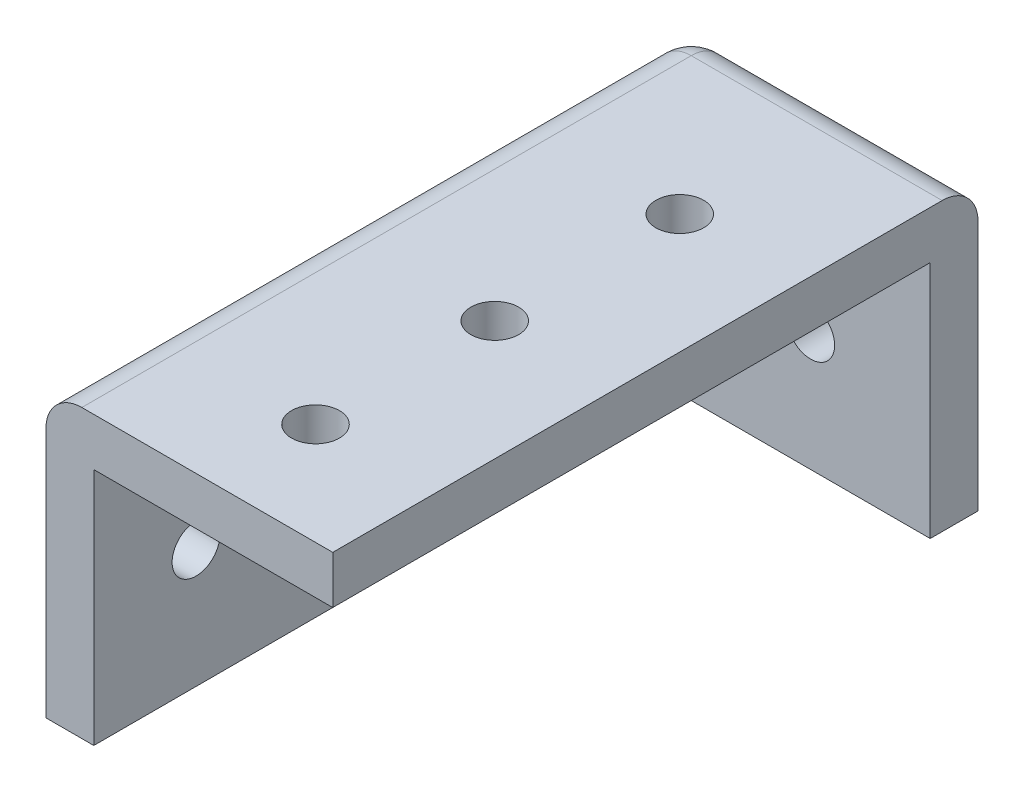
ISO-10303-21;
HEADER;
FILE_DESCRIPTION(('STEP AP214'),'2;1');
FILE_NAME('part.step','',(''),(''),'','','');
FILE_SCHEMA(('AUTOMOTIVE_DESIGN { 1 0 10303 214 1 1 1 1 }'));
ENDSEC;
DATA;
#1=APPLICATION_CONTEXT('core data for automotive mechanical design processes');
#2=APPLICATION_PROTOCOL_DEFINITION('international standard','automotive_design',2000,#1);
#3=PRODUCT_CONTEXT('',#1,'mechanical');
#4=PRODUCT('Part','Part','',(#3));
#5=PRODUCT_RELATED_PRODUCT_CATEGORY('part','',(#4));
#6=PRODUCT_DEFINITION_FORMATION('','',#4);
#7=PRODUCT_DEFINITION_CONTEXT('part definition',#1,'design');
#8=PRODUCT_DEFINITION('design','',#6,#7);
#9=PRODUCT_DEFINITION_SHAPE('','',#8);
#10=(LENGTH_UNIT() NAMED_UNIT(*) SI_UNIT(.MILLI.,.METRE.));
#11=(NAMED_UNIT(*) PLANE_ANGLE_UNIT() SI_UNIT($,.RADIAN.));
#12=(NAMED_UNIT(*) SI_UNIT($,.STERADIAN.) SOLID_ANGLE_UNIT());
#13=UNCERTAINTY_MEASURE_WITH_UNIT(LENGTH_MEASURE(1.E-05),#10,'distance_accuracy_value','');
#14=(GEOMETRIC_REPRESENTATION_CONTEXT(3) GLOBAL_UNCERTAINTY_ASSIGNED_CONTEXT((#13)) GLOBAL_UNIT_ASSIGNED_CONTEXT((#10,
#11,#12)) REPRESENTATION_CONTEXT('',''));
#15=CARTESIAN_POINT('',(0.,0.,0.));
#16=DIRECTION('',(0.,0.,1.));
#17=DIRECTION('',(1.,0.,0.));
#18=AXIS2_PLACEMENT_3D('',#15,#16,#17);
#19=CARTESIAN_POINT('',(4.,0.,50.));
#20=DIRECTION('',(0.,1.,0.));
#21=DIRECTION('',(0.,0.,1.));
#22=AXIS2_PLACEMENT_3D('',#19,#20,#21);
#23=PLANE('',#22);
#24=DIRECTION('',(0.,0.,-1.));
#25=VECTOR('',#24,1.);
#26=CARTESIAN_POINT('',(0.,0.,50.));
#27=LINE('',#26,#25);
#28=CARTESIAN_POINT('',(0.,0.,50.));
#29=VERTEX_POINT('',#28);
#30=CARTESIAN_POINT('',(0.,0.,-1.));
#31=VERTEX_POINT('',#30);
#32=EDGE_CURVE('E157',#29,#31,#27,.T.);
#33=ORIENTED_EDGE('',*,*,#32,.T.);
#34=CARTESIAN_POINT('',(3.,0.,-1.));
#35=DIRECTION('',(0.,1.,0.));
#36=DIRECTION('',(0.,0.,1.));
#37=AXIS2_PLACEMENT_3D('',#34,#35,#36);
#38=CIRCLE('',#37,3.);
#39=CARTESIAN_POINT('',(3.,0.,-4.));
#40=VERTEX_POINT('',#39);
#41=EDGE_CURVE('E119',#31,#40,#38,.F.);
#42=ORIENTED_EDGE('',*,*,#41,.T.);
#43=DIRECTION('',(1.,0.,0.));
#44=VECTOR('',#43,1.);
#45=CARTESIAN_POINT('',(0.,0.,-4.));
#46=LINE('',#45,#44);
#47=CARTESIAN_POINT('',(24.,0.,-4.));
#48=VERTEX_POINT('',#47);
#49=EDGE_CURVE('E113',#40,#48,#46,.T.);
#50=ORIENTED_EDGE('',*,*,#49,.T.);
#51=DIRECTION('',(0.,0.,1.));
#52=VECTOR('',#51,1.);
#53=CARTESIAN_POINT('',(24.,0.,-4.));
#54=LINE('',#53,#52);
#55=CARTESIAN_POINT('',(24.,0.,0.));
#56=VERTEX_POINT('',#55);
#57=EDGE_CURVE('E117',#48,#56,#54,.T.);
#58=ORIENTED_EDGE('',*,*,#57,.T.);
#59=DIRECTION('',(1.,0.,0.));
#60=VECTOR('',#59,1.);
#61=CARTESIAN_POINT('',(0.,0.,0.));
#62=LINE('',#61,#60);
#63=CARTESIAN_POINT('',(4.,0.,0.));
#64=VERTEX_POINT('',#63);
#65=EDGE_CURVE('E139',#64,#56,#62,.T.);
#66=ORIENTED_EDGE('',*,*,#65,.F.);
#67=DIRECTION('',(0.,0.,-1.));
#68=VECTOR('',#67,1.);
#69=CARTESIAN_POINT('',(4.,0.,50.));
#70=LINE('',#69,#68);
#71=CARTESIAN_POINT('',(4.,0.,50.));
#72=VERTEX_POINT('',#71);
#73=EDGE_CURVE('E170',#72,#64,#70,.T.);
#74=ORIENTED_EDGE('',*,*,#73,.F.);
#75=DIRECTION('',(1.,0.,0.));
#76=VECTOR('',#75,1.);
#77=CARTESIAN_POINT('',(4.,0.,50.));
#78=LINE('',#77,#76);
#79=EDGE_CURVE('E143',#29,#72,#78,.T.);
#80=ORIENTED_EDGE('',*,*,#79,.F.);
#81=EDGE_LOOP('',(#33,#42,#50,#58,#66,#74,#80));
#82=FACE_BOUND('',#81,.T.);
#83=ADVANCED_FACE('F38',(#82),#23,.F.);
#84=CARTESIAN_POINT('',(4.,20.,50.));
#85=DIRECTION('',(-1.,0.,0.));
#86=DIRECTION('',(0.,0.,1.));
#87=AXIS2_PLACEMENT_3D('',#84,#85,#86);
#88=PLANE('',#87);
#89=CARTESIAN_POINT('',(3.99999999999999,9.99999999999998,41.4458710177428));
#90=DIRECTION('',(1.,0.,0.));
#91=DIRECTION('',(0.,0.,1.));
#92=AXIS2_PLACEMENT_3D('',#89,#90,#91);
#93=CIRCLE('',#92,2.);
#94=CARTESIAN_POINT('',(3.99999999999999,9.99999999999998,43.4458710177428));
#95=VERTEX_POINT('',#94);
#96=EDGE_CURVE('E196',#95,#95,#93,.T.);
#97=ORIENTED_EDGE('',*,*,#96,.F.);
#98=EDGE_LOOP('',(#97));
#99=FACE_BOUND('',#98,.T.);
#100=CARTESIAN_POINT('',(3.99999999999999,9.99999999999998,10.9600417917341));
#101=DIRECTION('',(1.,0.,0.));
#102=DIRECTION('',(0.,0.,1.));
#103=AXIS2_PLACEMENT_3D('',#100,#101,#102);
#104=CIRCLE('',#103,2.);
#105=CARTESIAN_POINT('',(3.99999999999999,9.99999999999998,12.9600417917341));
#106=VERTEX_POINT('',#105);
#107=EDGE_CURVE('E212',#106,#106,#104,.T.);
#108=ORIENTED_EDGE('',*,*,#107,.F.);
#109=EDGE_LOOP('',(#108));
#110=FACE_BOUND('',#109,.T.);
#111=CARTESIAN_POINT('',(3.99999999999999,9.99999999999998,26.4458710177428));
#112=DIRECTION('',(1.,0.,0.));
#113=DIRECTION('',(0.,0.,1.));
#114=AXIS2_PLACEMENT_3D('',#111,#112,#113);
#115=CIRCLE('',#114,2.);
#116=CARTESIAN_POINT('',(3.99999999999999,9.99999999999998,28.4458710177428));
#117=VERTEX_POINT('',#116);
#118=EDGE_CURVE('E205',#117,#117,#115,.T.);
#119=ORIENTED_EDGE('',*,*,#118,.F.);
#120=EDGE_LOOP('',(#119));
#121=FACE_BOUND('',#120,.T.);
#122=DIRECTION('',(0.,1.,0.));
#123=VECTOR('',#122,1.);
#124=CARTESIAN_POINT('',(4.,20.,0.));
#125=LINE('',#124,#123);
#126=CARTESIAN_POINT('',(4.,20.,0.));
#127=VERTEX_POINT('',#126);
#128=EDGE_CURVE('E131',#64,#127,#125,.T.);
#129=ORIENTED_EDGE('',*,*,#128,.T.);
#130=DIRECTION('',(0.,0.,-1.));
#131=VECTOR('',#130,1.);
#132=CARTESIAN_POINT('',(4.,20.,50.));
#133=LINE('',#132,#131);
#134=CARTESIAN_POINT('',(4.,20.,50.));
#135=VERTEX_POINT('',#134);
#136=EDGE_CURVE('E167',#135,#127,#133,.T.);
#137=ORIENTED_EDGE('',*,*,#136,.F.);
#138=DIRECTION('',(0.,1.,0.));
#139=VECTOR('',#138,1.);
#140=CARTESIAN_POINT('',(4.,20.,50.));
#141=LINE('',#140,#139);
#142=EDGE_CURVE('E146',#72,#135,#141,.T.);
#143=ORIENTED_EDGE('',*,*,#142,.F.);
#144=ORIENTED_EDGE('',*,*,#73,.T.);
#145=EDGE_LOOP('',(#129,#137,#143,#144));
#146=FACE_BOUND('',#145,.T.);
#147=ADVANCED_FACE('F251',(#99,#110,#121,#146),#88,.F.);
#148=CARTESIAN_POINT('',(24.,20.,50.));
#149=DIRECTION('',(0.,1.,0.));
#150=DIRECTION('',(-1.,0.,0.));
#151=AXIS2_PLACEMENT_3D('',#148,#149,#150);
#152=PLANE('',#151);
#153=CARTESIAN_POINT('',(14.,20.,41.4458710177428));
#154=DIRECTION('',(0.,1.,0.));
#155=DIRECTION('',(0.,0.,1.));
#156=AXIS2_PLACEMENT_3D('',#153,#154,#155);
#157=CIRCLE('',#156,2.);
#158=CARTESIAN_POINT('',(14.,20.,43.4458710177428));
#159=VERTEX_POINT('',#158);
#160=EDGE_CURVE('E208',#159,#159,#157,.T.);
#161=ORIENTED_EDGE('',*,*,#160,.T.);
#162=EDGE_LOOP('',(#161));
#163=FACE_BOUND('',#162,.T.);
#164=CARTESIAN_POINT('',(14.,20.,10.9600417917341));
#165=DIRECTION('',(0.,1.,0.));
#166=DIRECTION('',(0.,0.,1.));
#167=AXIS2_PLACEMENT_3D('',#164,#165,#166);
#168=CIRCLE('',#167,2.);
#169=CARTESIAN_POINT('',(14.,20.,12.9600417917341));
#170=VERTEX_POINT('',#169);
#171=EDGE_CURVE('E217',#170,#170,#168,.T.);
#172=ORIENTED_EDGE('',*,*,#171,.T.);
#173=EDGE_LOOP('',(#172));
#174=FACE_BOUND('',#173,.T.);
#175=CARTESIAN_POINT('',(14.,20.,26.4458710177428));
#176=DIRECTION('',(0.,1.,0.));
#177=DIRECTION('',(0.,0.,1.));
#178=AXIS2_PLACEMENT_3D('',#175,#176,#177);
#179=CIRCLE('',#178,2.);
#180=CARTESIAN_POINT('',(14.,20.,28.4458710177428));
#181=VERTEX_POINT('',#180);
#182=EDGE_CURVE('E225',#181,#181,#179,.T.);
#183=ORIENTED_EDGE('',*,*,#182,.T.);
#184=EDGE_LOOP('',(#183));
#185=FACE_BOUND('',#184,.T.);
#186=DIRECTION('',(1.,0.,0.));
#187=VECTOR('',#186,1.);
#188=CARTESIAN_POINT('',(24.,20.,0.));
#189=LINE('',#188,#187);
#190=CARTESIAN_POINT('',(24.,20.,0.));
#191=VERTEX_POINT('',#190);
#192=EDGE_CURVE('E147',#127,#191,#189,.T.);
#193=ORIENTED_EDGE('',*,*,#192,.T.);
#194=DIRECTION('',(0.,0.,-1.));
#195=VECTOR('',#194,1.);
#196=CARTESIAN_POINT('',(24.,20.,50.));
#197=LINE('',#196,#195);
#198=CARTESIAN_POINT('',(24.,20.,50.));
#199=VERTEX_POINT('',#198);
#200=EDGE_CURVE('E165',#199,#191,#197,.T.);
#201=ORIENTED_EDGE('',*,*,#200,.F.);
#202=DIRECTION('',(1.,0.,0.));
#203=VECTOR('',#202,1.);
#204=CARTESIAN_POINT('',(24.,20.,50.));
#205=LINE('',#204,#203);
#206=EDGE_CURVE('E149',#135,#199,#205,.T.);
#207=ORIENTED_EDGE('',*,*,#206,.F.);
#208=ORIENTED_EDGE('',*,*,#136,.T.);
#209=EDGE_LOOP('',(#193,#201,#207,#208));
#210=FACE_BOUND('',#209,.T.);
#211=ADVANCED_FACE('F256',(#163,#174,#185,#210),#152,.F.);
#212=CARTESIAN_POINT('',(24.,24.,50.));
#213=DIRECTION('',(-1.,0.,0.));
#214=DIRECTION('',(0.,0.,1.));
#215=AXIS2_PLACEMENT_3D('',#212,#213,#214);
#216=PLANE('',#215);
#217=DIRECTION('',(0.,1.,0.));
#218=VECTOR('',#217,1.);
#219=CARTESIAN_POINT('',(24.,0.,-4.));
#220=LINE('',#219,#218);
#221=CARTESIAN_POINT('',(24.,21.,-4.));
#222=VERTEX_POINT('',#221);
#223=EDGE_CURVE('E123',#48,#222,#220,.T.);
#224=ORIENTED_EDGE('',*,*,#223,.T.);
#225=CARTESIAN_POINT('',(24.,21.,-1.));
#226=DIRECTION('',(-1.,0.,0.));
#227=DIRECTION('',(0.,0.,1.));
#228=AXIS2_PLACEMENT_3D('',#225,#226,#227);
#229=CIRCLE('',#228,3.);
#230=CARTESIAN_POINT('',(24.,24.,-1.));
#231=VERTEX_POINT('',#230);
#232=EDGE_CURVE('E47',#222,#231,#229,.F.);
#233=ORIENTED_EDGE('',*,*,#232,.T.);
#234=DIRECTION('',(0.,0.,-1.));
#235=VECTOR('',#234,1.);
#236=CARTESIAN_POINT('',(24.,24.,50.));
#237=LINE('',#236,#235);
#238=CARTESIAN_POINT('',(24.,24.,50.));
#239=VERTEX_POINT('',#238);
#240=EDGE_CURVE('E163',#239,#231,#237,.T.);
#241=ORIENTED_EDGE('',*,*,#240,.F.);
#242=DIRECTION('',(0.,1.,0.));
#243=VECTOR('',#242,1.);
#244=CARTESIAN_POINT('',(24.,24.,50.));
#245=LINE('',#244,#243);
#246=EDGE_CURVE('E151',#199,#239,#245,.T.);
#247=ORIENTED_EDGE('',*,*,#246,.F.);
#248=ORIENTED_EDGE('',*,*,#200,.T.);
#249=DIRECTION('',(0.,1.,0.));
#250=VECTOR('',#249,1.);
#251=CARTESIAN_POINT('',(24.,0.,0.));
#252=LINE('',#251,#250);
#253=EDGE_CURVE('E124',#56,#191,#252,.T.);
#254=ORIENTED_EDGE('',*,*,#253,.F.);
#255=ORIENTED_EDGE('',*,*,#57,.F.);
#256=EDGE_LOOP('',(#224,#233,#241,#247,#248,#254,#255));
#257=FACE_BOUND('',#256,.T.);
#258=ADVANCED_FACE('F128',(#257),#216,.F.);
#259=CARTESIAN_POINT('',(0.,24.,50.));
#260=DIRECTION('',(0.,-1.,0.));
#261=DIRECTION('',(0.,0.,-1.));
#262=AXIS2_PLACEMENT_3D('',#259,#260,#261);
#263=PLANE('',#262);
#264=CARTESIAN_POINT('',(14.,24.,41.4458710177428));
#265=DIRECTION('',(0.,1.,0.));
#266=DIRECTION('',(0.,0.,1.));
#267=AXIS2_PLACEMENT_3D('',#264,#265,#266);
#268=CIRCLE('',#267,2.);
#269=CARTESIAN_POINT('',(14.,24.,43.4458710177428));
#270=VERTEX_POINT('',#269);
#271=EDGE_CURVE('E220',#270,#270,#268,.T.);
#272=ORIENTED_EDGE('',*,*,#271,.F.);
#273=EDGE_LOOP('',(#272));
#274=FACE_BOUND('',#273,.T.);
#275=CARTESIAN_POINT('',(14.,24.,10.9600417917341));
#276=DIRECTION('',(0.,1.,0.));
#277=DIRECTION('',(0.,0.,1.));
#278=AXIS2_PLACEMENT_3D('',#275,#276,#277);
#279=CIRCLE('',#278,2.);
#280=CARTESIAN_POINT('',(14.,24.,12.9600417917341));
#281=VERTEX_POINT('',#280);
#282=EDGE_CURVE('E213',#281,#281,#279,.T.);
#283=ORIENTED_EDGE('',*,*,#282,.F.);
#284=EDGE_LOOP('',(#283));
#285=FACE_BOUND('',#284,.T.);
#286=CARTESIAN_POINT('',(14.,24.,26.4458710177428));
#287=DIRECTION('',(0.,1.,0.));
#288=DIRECTION('',(0.,0.,1.));
#289=AXIS2_PLACEMENT_3D('',#286,#287,#288);
#290=CIRCLE('',#289,2.);
#291=CARTESIAN_POINT('',(14.,24.,28.4458710177428));
#292=VERTEX_POINT('',#291);
#293=EDGE_CURVE('E216',#292,#292,#290,.T.);
#294=ORIENTED_EDGE('',*,*,#293,.F.);
#295=EDGE_LOOP('',(#294));
#296=FACE_BOUND('',#295,.T.);
#297=ORIENTED_EDGE('',*,*,#240,.T.);
#298=DIRECTION('',(-1.,0.,0.));
#299=VECTOR('',#298,1.);
#300=CARTESIAN_POINT('',(0.,24.,-1.));
#301=LINE('',#300,#299);
#302=CARTESIAN_POINT('',(3.,24.,-1.));
#303=VERTEX_POINT('',#302);
#304=EDGE_CURVE('E55',#231,#303,#301,.T.);
#305=ORIENTED_EDGE('',*,*,#304,.T.);
#306=DIRECTION('',(0.,0.,-1.));
#307=VECTOR('',#306,1.);
#308=CARTESIAN_POINT('',(3.,24.,50.));
#309=LINE('',#308,#307);
#310=CARTESIAN_POINT('',(3.,24.,50.));
#311=VERTEX_POINT('',#310);
#312=EDGE_CURVE('E59',#303,#311,#309,.F.);
#313=ORIENTED_EDGE('',*,*,#312,.T.);
#314=DIRECTION('',(-1.,0.,0.));
#315=VECTOR('',#314,1.);
#316=CARTESIAN_POINT('',(0.,24.,50.));
#317=LINE('',#316,#315);
#318=EDGE_CURVE('E153',#239,#311,#317,.T.);
#319=ORIENTED_EDGE('',*,*,#318,.F.);
#320=EDGE_LOOP('',(#297,#305,#313,#319));
#321=FACE_BOUND('',#320,.T.);
#322=ADVANCED_FACE('F292',(#274,#285,#296,#321),#263,.F.);
#323=CARTESIAN_POINT('',(0.,0.,50.));
#324=DIRECTION('',(1.,0.,0.));
#325=DIRECTION('',(0.,0.,-1.));
#326=AXIS2_PLACEMENT_3D('',#323,#324,#325);
#327=PLANE('',#326);
#328=CARTESIAN_POINT('',(0.,9.99999999999998,41.4458710177428));
#329=DIRECTION('',(1.,0.,0.));
#330=DIRECTION('',(0.,0.,1.));
#331=AXIS2_PLACEMENT_3D('',#328,#329,#330);
#332=CIRCLE('',#331,2.);
#333=CARTESIAN_POINT('',(0.,9.99999999999998,43.4458710177428));
#334=VERTEX_POINT('',#333);
#335=EDGE_CURVE('E193',#334,#334,#332,.T.);
#336=ORIENTED_EDGE('',*,*,#335,.T.);
#337=EDGE_LOOP('',(#336));
#338=FACE_BOUND('',#337,.T.);
#339=CARTESIAN_POINT('',(0.,9.99999999999998,10.9600417917341));
#340=DIRECTION('',(1.,0.,0.));
#341=DIRECTION('',(0.,0.,1.));
#342=AXIS2_PLACEMENT_3D('',#339,#340,#341);
#343=CIRCLE('',#342,2.);
#344=CARTESIAN_POINT('',(0.,9.99999999999998,12.9600417917341));
#345=VERTEX_POINT('',#344);
#346=EDGE_CURVE('E201',#345,#345,#343,.T.);
#347=ORIENTED_EDGE('',*,*,#346,.T.);
#348=EDGE_LOOP('',(#347));
#349=FACE_BOUND('',#348,.T.);
#350=CARTESIAN_POINT('',(0.,9.99999999999998,26.4458710177428));
#351=DIRECTION('',(1.,0.,0.));
#352=DIRECTION('',(0.,0.,1.));
#353=AXIS2_PLACEMENT_3D('',#350,#351,#352);
#354=CIRCLE('',#353,2.);
#355=CARTESIAN_POINT('',(0.,9.99999999999998,28.4458710177428));
#356=VERTEX_POINT('',#355);
#357=EDGE_CURVE('E209',#356,#356,#354,.T.);
#358=ORIENTED_EDGE('',*,*,#357,.T.);
#359=EDGE_LOOP('',(#358));
#360=FACE_BOUND('',#359,.T.);
#361=DIRECTION('',(0.,0.,-1.));
#362=VECTOR('',#361,1.);
#363=CARTESIAN_POINT('',(0.,21.,50.));
#364=LINE('',#363,#362);
#365=CARTESIAN_POINT('',(0.,21.,50.));
#366=VERTEX_POINT('',#365);
#367=CARTESIAN_POINT('',(0.,21.,-1.));
#368=VERTEX_POINT('',#367);
#369=EDGE_CURVE('E173',#366,#368,#364,.T.);
#370=ORIENTED_EDGE('',*,*,#369,.T.);
#371=DIRECTION('',(0.,-1.,0.));
#372=VECTOR('',#371,1.);
#373=CARTESIAN_POINT('',(0.,0.,-1.));
#374=LINE('',#373,#372);
#375=EDGE_CURVE('E175',#368,#31,#374,.T.);
#376=ORIENTED_EDGE('',*,*,#375,.T.);
#377=ORIENTED_EDGE('',*,*,#32,.F.);
#378=DIRECTION('',(0.,-1.,0.));
#379=VECTOR('',#378,1.);
#380=CARTESIAN_POINT('',(0.,0.,50.));
#381=LINE('',#380,#379);
#382=EDGE_CURVE('E155',#366,#29,#381,.T.);
#383=ORIENTED_EDGE('',*,*,#382,.F.);
#384=EDGE_LOOP('',(#370,#376,#377,#383));
#385=FACE_BOUND('',#384,.T.);
#386=ADVANCED_FACE('F281',(#338,#349,#360,#385),#327,.F.);
#387=CARTESIAN_POINT('',(0.,0.,50.));
#388=DIRECTION('',(0.,0.,-1.));
#389=DIRECTION('',(-1.,0.,0.));
#390=AXIS2_PLACEMENT_3D('',#387,#388,#389);
#391=PLANE('',#390);
#392=ORIENTED_EDGE('',*,*,#318,.T.);
#393=CARTESIAN_POINT('',(3.,21.,50.));
#394=DIRECTION('',(0.,0.,-1.));
#395=DIRECTION('',(-1.,0.,0.));
#396=AXIS2_PLACEMENT_3D('',#393,#394,#395);
#397=CIRCLE('',#396,3.);
#398=EDGE_CURVE('E11',#311,#366,#397,.F.);
#399=ORIENTED_EDGE('',*,*,#398,.T.);
#400=ORIENTED_EDGE('',*,*,#382,.T.);
#401=ORIENTED_EDGE('',*,*,#79,.T.);
#402=ORIENTED_EDGE('',*,*,#142,.T.);
#403=ORIENTED_EDGE('',*,*,#206,.T.);
#404=ORIENTED_EDGE('',*,*,#246,.T.);
#405=EDGE_LOOP('',(#392,#399,#400,#401,#402,#403,#404));
#406=FACE_BOUND('',#405,.T.);
#407=ADVANCED_FACE('F247',(#406),#391,.F.);
#408=CARTESIAN_POINT('',(0.,0.,0.));
#409=DIRECTION('',(0.,0.,1.));
#410=DIRECTION('',(1.,0.,0.));
#411=AXIS2_PLACEMENT_3D('',#408,#409,#410);
#412=PLANE('',#411);
#413=CARTESIAN_POINT('',(14.,10.,0.));
#414=DIRECTION('',(0.,0.,-1.));
#415=DIRECTION('',(-1.,0.,0.));
#416=AXIS2_PLACEMENT_3D('',#413,#414,#415);
#417=CIRCLE('',#416,2.);
#418=CARTESIAN_POINT('',(12.,10.,0.));
#419=VERTEX_POINT('',#418);
#420=EDGE_CURVE('E141',#419,#419,#417,.T.);
#421=ORIENTED_EDGE('',*,*,#420,.T.);
#422=EDGE_LOOP('',(#421));
#423=FACE_BOUND('',#422,.T.);
#424=ORIENTED_EDGE('',*,*,#192,.F.);
#425=ORIENTED_EDGE('',*,*,#128,.F.);
#426=ORIENTED_EDGE('',*,*,#65,.T.);
#427=ORIENTED_EDGE('',*,*,#253,.T.);
#428=EDGE_LOOP('',(#424,#425,#426,#427));
#429=FACE_BOUND('',#428,.T.);
#430=ADVANCED_FACE('F238',(#423,#429),#412,.T.);
#431=CARTESIAN_POINT('',(0.,0.,-4.));
#432=DIRECTION('',(0.,0.,1.));
#433=DIRECTION('',(1.,0.,0.));
#434=AXIS2_PLACEMENT_3D('',#431,#432,#433);
#435=PLANE('',#434);
#436=CARTESIAN_POINT('',(14.,10.,-4.));
#437=DIRECTION('',(0.,0.,-1.));
#438=DIRECTION('',(-1.,0.,0.));
#439=AXIS2_PLACEMENT_3D('',#436,#437,#438);
#440=CIRCLE('',#439,2.);
#441=CARTESIAN_POINT('',(12.,10.,-4.));
#442=VERTEX_POINT('',#441);
#443=EDGE_CURVE('E228',#442,#442,#440,.T.);
#444=ORIENTED_EDGE('',*,*,#443,.F.);
#445=EDGE_LOOP('',(#444));
#446=FACE_BOUND('',#445,.T.);
#447=ORIENTED_EDGE('',*,*,#49,.F.);
#448=DIRECTION('',(0.,-1.,0.));
#449=VECTOR('',#448,1.);
#450=CARTESIAN_POINT('',(3.,0.,-4.));
#451=LINE('',#450,#449);
#452=CARTESIAN_POINT('',(3.,21.,-4.));
#453=VERTEX_POINT('',#452);
#454=EDGE_CURVE('E180',#40,#453,#451,.F.);
#455=ORIENTED_EDGE('',*,*,#454,.T.);
#456=DIRECTION('',(-1.,0.,0.));
#457=VECTOR('',#456,1.);
#458=CARTESIAN_POINT('',(0.,21.,-4.));
#459=LINE('',#458,#457);
#460=EDGE_CURVE('E135',#453,#222,#459,.F.);
#461=ORIENTED_EDGE('',*,*,#460,.T.);
#462=ORIENTED_EDGE('',*,*,#223,.F.);
#463=EDGE_LOOP('',(#447,#455,#461,#462));
#464=FACE_BOUND('',#463,.T.);
#465=ADVANCED_FACE('F133',(#446,#464),#435,.F.);
#466=CARTESIAN_POINT('',(14.,10.,0.));
#467=DIRECTION('',(0.,0.,-1.));
#468=DIRECTION('',(-1.,0.,0.));
#469=AXIS2_PLACEMENT_3D('',#466,#467,#468);
#470=CYLINDRICAL_SURFACE('',#469,2.);
#471=ORIENTED_EDGE('',*,*,#420,.F.);
#472=EDGE_LOOP('',(#471));
#473=FACE_BOUND('',#472,.T.);
#474=ORIENTED_EDGE('',*,*,#443,.T.);
#475=EDGE_LOOP('',(#474));
#476=FACE_BOUND('',#475,.T.);
#477=ADVANCED_FACE('F235',(#473,#476),#470,.F.);
#478=CARTESIAN_POINT('',(14.,20.,26.4458710177428));
#479=DIRECTION('',(0.,1.,0.));
#480=DIRECTION('',(0.,0.,1.));
#481=AXIS2_PLACEMENT_3D('',#478,#479,#480);
#482=CYLINDRICAL_SURFACE('',#481,2.);
#483=ORIENTED_EDGE('',*,*,#182,.F.);
#484=EDGE_LOOP('',(#483));
#485=FACE_BOUND('',#484,.T.);
#486=ORIENTED_EDGE('',*,*,#293,.T.);
#487=EDGE_LOOP('',(#486));
#488=FACE_BOUND('',#487,.T.);
#489=ADVANCED_FACE('F244',(#485,#488),#482,.F.);
#490=CARTESIAN_POINT('',(14.,20.,10.9600417917341));
#491=DIRECTION('',(0.,1.,0.));
#492=DIRECTION('',(0.,0.,1.));
#493=AXIS2_PLACEMENT_3D('',#490,#491,#492);
#494=CYLINDRICAL_SURFACE('',#493,2.);
#495=ORIENTED_EDGE('',*,*,#171,.F.);
#496=EDGE_LOOP('',(#495));
#497=FACE_BOUND('',#496,.T.);
#498=ORIENTED_EDGE('',*,*,#282,.T.);
#499=EDGE_LOOP('',(#498));
#500=FACE_BOUND('',#499,.T.);
#501=ADVANCED_FACE('F317',(#497,#500),#494,.F.);
#502=CARTESIAN_POINT('',(14.,20.,41.4458710177428));
#503=DIRECTION('',(0.,1.,0.));
#504=DIRECTION('',(0.,0.,1.));
#505=AXIS2_PLACEMENT_3D('',#502,#503,#504);
#506=CYLINDRICAL_SURFACE('',#505,2.);
#507=ORIENTED_EDGE('',*,*,#160,.F.);
#508=EDGE_LOOP('',(#507));
#509=FACE_BOUND('',#508,.T.);
#510=ORIENTED_EDGE('',*,*,#271,.T.);
#511=EDGE_LOOP('',(#510));
#512=FACE_BOUND('',#511,.T.);
#513=ADVANCED_FACE('F324',(#509,#512),#506,.F.);
#514=CARTESIAN_POINT('',(3.99999999999999,9.99999999999998,26.4458710177428));
#515=DIRECTION('',(-1.,0.,0.));
#516=DIRECTION('',(0.,-1.,0.));
#517=AXIS2_PLACEMENT_3D('',#514,#515,#516);
#518=CYLINDRICAL_SURFACE('',#517,2.);
#519=ORIENTED_EDGE('',*,*,#118,.T.);
#520=EDGE_LOOP('',(#519));
#521=FACE_BOUND('',#520,.T.);
#522=ORIENTED_EDGE('',*,*,#357,.F.);
#523=EDGE_LOOP('',(#522));
#524=FACE_BOUND('',#523,.T.);
#525=ADVANCED_FACE('F329',(#521,#524),#518,.F.);
#526=CARTESIAN_POINT('',(3.99999999999999,9.99999999999998,10.9600417917341));
#527=DIRECTION('',(-1.,0.,0.));
#528=DIRECTION('',(0.,-1.,0.));
#529=AXIS2_PLACEMENT_3D('',#526,#527,#528);
#530=CYLINDRICAL_SURFACE('',#529,2.);
#531=ORIENTED_EDGE('',*,*,#107,.T.);
#532=EDGE_LOOP('',(#531));
#533=FACE_BOUND('',#532,.T.);
#534=ORIENTED_EDGE('',*,*,#346,.F.);
#535=EDGE_LOOP('',(#534));
#536=FACE_BOUND('',#535,.T.);
#537=ADVANCED_FACE('F334',(#533,#536),#530,.F.);
#538=CARTESIAN_POINT('',(3.99999999999999,9.99999999999998,41.4458710177428));
#539=DIRECTION('',(-1.,0.,0.));
#540=DIRECTION('',(0.,-1.,0.));
#541=AXIS2_PLACEMENT_3D('',#538,#539,#540);
#542=CYLINDRICAL_SURFACE('',#541,2.);
#543=ORIENTED_EDGE('',*,*,#96,.T.);
#544=EDGE_LOOP('',(#543));
#545=FACE_BOUND('',#544,.T.);
#546=ORIENTED_EDGE('',*,*,#335,.F.);
#547=EDGE_LOOP('',(#546));
#548=FACE_BOUND('',#547,.T.);
#549=ADVANCED_FACE('F273',(#545,#548),#542,.F.);
#550=CARTESIAN_POINT('',(0.,21.,-1.));
#551=DIRECTION('',(-1.,0.,0.));
#552=DIRECTION('',(0.,0.,1.));
#553=AXIS2_PLACEMENT_3D('',#550,#551,#552);
#554=CYLINDRICAL_SURFACE('',#553,3.);
#555=ORIENTED_EDGE('',*,*,#232,.F.);
#556=ORIENTED_EDGE('',*,*,#460,.F.);
#557=CARTESIAN_POINT('',(3.,21.,-1.));
#558=DIRECTION('',(-1.,0.,0.));
#559=DIRECTION('',(0.,0.,1.));
#560=AXIS2_PLACEMENT_3D('',#557,#558,#559);
#561=CIRCLE('',#560,3.);
#562=EDGE_CURVE('E42',#303,#453,#561,.T.);
#563=ORIENTED_EDGE('',*,*,#562,.F.);
#564=ORIENTED_EDGE('',*,*,#304,.F.);
#565=EDGE_LOOP('',(#555,#556,#563,#564));
#566=FACE_BOUND('',#565,.T.);
#567=ADVANCED_FACE('F40',(#566),#554,.T.);
#568=CARTESIAN_POINT('',(3.,21.,50.));
#569=DIRECTION('',(0.,0.,-1.));
#570=DIRECTION('',(-1.,0.,0.));
#571=AXIS2_PLACEMENT_3D('',#568,#569,#570);
#572=CYLINDRICAL_SURFACE('',#571,3.);
#573=ORIENTED_EDGE('',*,*,#398,.F.);
#574=ORIENTED_EDGE('',*,*,#312,.F.);
#575=CARTESIAN_POINT('',(3.,21.,-1.));
#576=DIRECTION('',(0.,0.,-1.));
#577=DIRECTION('',(-1.,0.,0.));
#578=AXIS2_PLACEMENT_3D('',#575,#576,#577);
#579=CIRCLE('',#578,3.);
#580=EDGE_CURVE('E187',#368,#303,#579,.T.);
#581=ORIENTED_EDGE('',*,*,#580,.F.);
#582=ORIENTED_EDGE('',*,*,#369,.F.);
#583=EDGE_LOOP('',(#573,#574,#581,#582));
#584=FACE_BOUND('',#583,.T.);
#585=ADVANCED_FACE('F267',(#584),#572,.T.);
#586=CARTESIAN_POINT('',(3.,21.,-1.));
#587=DIRECTION('',(0.,0.,1.));
#588=DIRECTION('',(1.,0.,0.));
#589=AXIS2_PLACEMENT_3D('',#586,#587,#588);
#590=SPHERICAL_SURFACE('',#589,3.);
#591=ORIENTED_EDGE('',*,*,#580,.T.);
#592=ORIENTED_EDGE('',*,*,#562,.T.);
#593=CARTESIAN_POINT('',(3.,21.,-1.));
#594=DIRECTION('',(0.,1.,0.));
#595=DIRECTION('',(0.,0.,1.));
#596=AXIS2_PLACEMENT_3D('',#593,#594,#595);
#597=CIRCLE('',#596,3.);
#598=EDGE_CURVE('E185',#368,#453,#597,.F.);
#599=ORIENTED_EDGE('',*,*,#598,.F.);
#600=EDGE_LOOP('',(#591,#592,#599));
#601=FACE_BOUND('',#600,.T.);
#602=ADVANCED_FACE('F264',(#601),#590,.T.);
#603=CARTESIAN_POINT('',(3.,0.,-1.));
#604=DIRECTION('',(0.,-1.,0.));
#605=DIRECTION('',(0.,0.,-1.));
#606=AXIS2_PLACEMENT_3D('',#603,#604,#605);
#607=CYLINDRICAL_SURFACE('',#606,3.);
#608=ORIENTED_EDGE('',*,*,#598,.T.);
#609=ORIENTED_EDGE('',*,*,#454,.F.);
#610=ORIENTED_EDGE('',*,*,#41,.F.);
#611=ORIENTED_EDGE('',*,*,#375,.F.);
#612=EDGE_LOOP('',(#608,#609,#610,#611));
#613=FACE_BOUND('',#612,.T.);
#614=ADVANCED_FACE('F261',(#613),#607,.T.);
#615=CLOSED_SHELL('',(#83,#147,#211,#258,#322,#386,#407,#430,#465,#477,#489,#501,#513,#525,#537,
#549,#567,#585,#602,#614));
#616=MANIFOLD_SOLID_BREP('B2',#615);
#617=ADVANCED_BREP_SHAPE_REPRESENTATION('',(#18,#616),#14);
#618=SHAPE_DEFINITION_REPRESENTATION(#9,#617);
ENDSEC;
END-ISO-10303-21;
